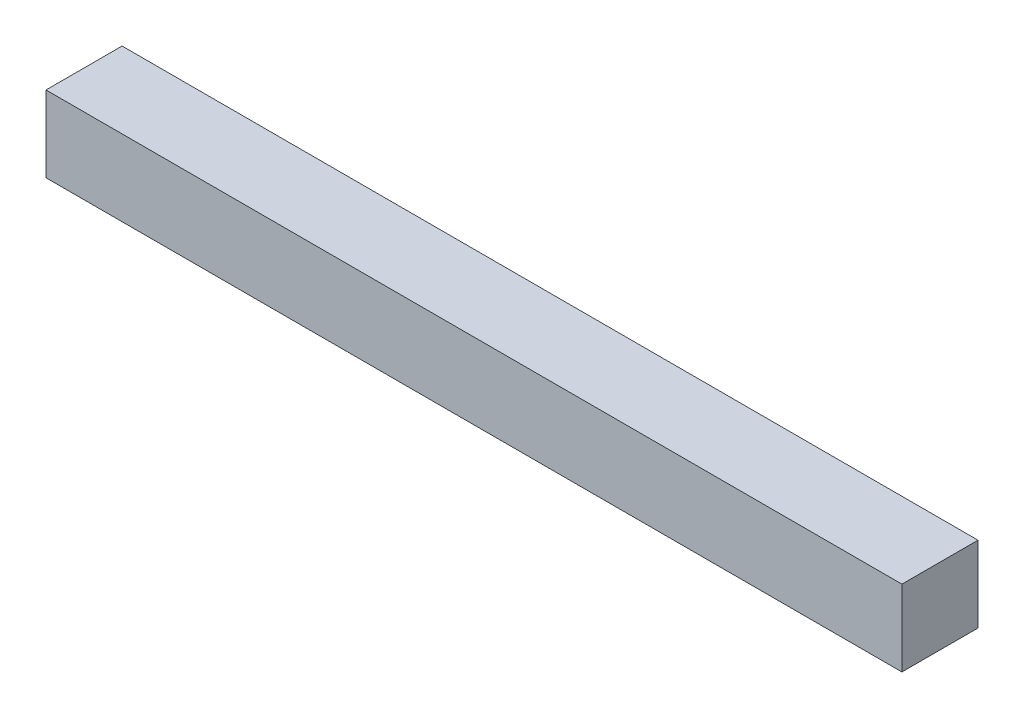
ISO-10303-21;
HEADER;
FILE_DESCRIPTION(('STEP AP214'),'2;1');
FILE_NAME('part.step','',(''),(''),'','','');
FILE_SCHEMA(('AUTOMOTIVE_DESIGN { 1 0 10303 214 1 1 1 1 }'));
ENDSEC;
DATA;
#1=APPLICATION_CONTEXT('core data for automotive mechanical design processes');
#2=APPLICATION_PROTOCOL_DEFINITION('international standard','automotive_design',2000,#1);
#3=PRODUCT_CONTEXT('',#1,'mechanical');
#4=PRODUCT('Part','Part','',(#3));
#5=PRODUCT_RELATED_PRODUCT_CATEGORY('part','',(#4));
#6=PRODUCT_DEFINITION_FORMATION('','',#4);
#7=PRODUCT_DEFINITION_CONTEXT('part definition',#1,'design');
#8=PRODUCT_DEFINITION('design','',#6,#7);
#9=PRODUCT_DEFINITION_SHAPE('','',#8);
#10=(LENGTH_UNIT() NAMED_UNIT(*) SI_UNIT(.MILLI.,.METRE.));
#11=(NAMED_UNIT(*) PLANE_ANGLE_UNIT() SI_UNIT($,.RADIAN.));
#12=(NAMED_UNIT(*) SI_UNIT($,.STERADIAN.) SOLID_ANGLE_UNIT());
#13=UNCERTAINTY_MEASURE_WITH_UNIT(LENGTH_MEASURE(1.E-05),#10,'distance_accuracy_value','');
#14=(GEOMETRIC_REPRESENTATION_CONTEXT(3) GLOBAL_UNCERTAINTY_ASSIGNED_CONTEXT((#13)) GLOBAL_UNIT_ASSIGNED_CONTEXT((#10,
#11,#12)) REPRESENTATION_CONTEXT('',''));
#15=CARTESIAN_POINT('',(0.,0.,0.));
#16=DIRECTION('',(0.,0.,1.));
#17=DIRECTION('',(1.,0.,0.));
#18=AXIS2_PLACEMENT_3D('',#15,#16,#17);
#19=CARTESIAN_POINT('',(0.,2.4,0.));
#20=DIRECTION('',(1.,0.,0.));
#21=DIRECTION('',(0.,0.,-1.));
#22=AXIS2_PLACEMENT_3D('',#19,#20,#21);
#23=PLANE('',#22);
#24=DIRECTION('',(0.,0.,1.));
#25=VECTOR('',#24,1.);
#26=CARTESIAN_POINT('',(0.,0.,0.));
#27=LINE('',#26,#25);
#28=CARTESIAN_POINT('',(0.,0.,-2.4));
#29=VERTEX_POINT('',#28);
#30=CARTESIAN_POINT('',(0.,0.,0.));
#31=VERTEX_POINT('',#30);
#32=EDGE_CURVE('E107',#29,#31,#27,.T.);
#33=ORIENTED_EDGE('',*,*,#32,.T.);
#34=DIRECTION('',(0.,-1.,0.));
#35=VECTOR('',#34,1.);
#36=CARTESIAN_POINT('',(0.,2.4,0.));
#37=LINE('',#36,#35);
#38=CARTESIAN_POINT('',(0.,2.4,0.));
#39=VERTEX_POINT('',#38);
#40=EDGE_CURVE('E11',#39,#31,#37,.T.);
#41=ORIENTED_EDGE('',*,*,#40,.F.);
#42=DIRECTION('',(0.,0.,1.));
#43=VECTOR('',#42,1.);
#44=CARTESIAN_POINT('',(0.,2.4,0.));
#45=LINE('',#44,#43);
#46=CARTESIAN_POINT('',(0.,2.4,-2.4));
#47=VERTEX_POINT('',#46);
#48=EDGE_CURVE('E91',#47,#39,#45,.T.);
#49=ORIENTED_EDGE('',*,*,#48,.F.);
#50=DIRECTION('',(0.,-1.,0.));
#51=VECTOR('',#50,1.);
#52=CARTESIAN_POINT('',(0.,2.4,-2.4));
#53=LINE('',#52,#51);
#54=EDGE_CURVE('E103',#47,#29,#53,.T.);
#55=ORIENTED_EDGE('',*,*,#54,.T.);
#56=EDGE_LOOP('',(#33,#41,#49,#55));
#57=FACE_BOUND('',#56,.T.);
#58=ADVANCED_FACE('F39',(#57),#23,.F.);
#59=CARTESIAN_POINT('',(0.,2.4,0.));
#60=DIRECTION('',(0.,0.,-1.));
#61=DIRECTION('',(-1.,0.,0.));
#62=AXIS2_PLACEMENT_3D('',#59,#60,#61);
#63=PLANE('',#62);
#64=DIRECTION('',(1.,0.,0.));
#65=VECTOR('',#64,1.);
#66=CARTESIAN_POINT('',(0.,0.,0.));
#67=LINE('',#66,#65);
#68=CARTESIAN_POINT('',(27.,0.,0.));
#69=VERTEX_POINT('',#68);
#70=EDGE_CURVE('E96',#31,#69,#67,.T.);
#71=ORIENTED_EDGE('',*,*,#70,.T.);
#72=DIRECTION('',(0.,-1.,0.));
#73=VECTOR('',#72,1.);
#74=CARTESIAN_POINT('',(27.,2.4,0.));
#75=LINE('',#74,#73);
#76=CARTESIAN_POINT('',(27.,2.4,0.));
#77=VERTEX_POINT('',#76);
#78=EDGE_CURVE('E48',#77,#69,#75,.T.);
#79=ORIENTED_EDGE('',*,*,#78,.F.);
#80=DIRECTION('',(1.,0.,0.));
#81=VECTOR('',#80,1.);
#82=CARTESIAN_POINT('',(0.,2.4,0.));
#83=LINE('',#82,#81);
#84=EDGE_CURVE('E86',#39,#77,#83,.T.);
#85=ORIENTED_EDGE('',*,*,#84,.F.);
#86=ORIENTED_EDGE('',*,*,#40,.T.);
#87=EDGE_LOOP('',(#71,#79,#85,#86));
#88=FACE_BOUND('',#87,.T.);
#89=ADVANCED_FACE('F95',(#88),#63,.F.);
#90=CARTESIAN_POINT('',(27.,2.4,0.));
#91=DIRECTION('',(-1.,0.,0.));
#92=DIRECTION('',(0.,0.,1.));
#93=AXIS2_PLACEMENT_3D('',#90,#91,#92);
#94=PLANE('',#93);
#95=DIRECTION('',(0.,0.,-1.));
#96=VECTOR('',#95,1.);
#97=CARTESIAN_POINT('',(27.,0.,0.));
#98=LINE('',#97,#96);
#99=CARTESIAN_POINT('',(27.,0.,-2.4));
#100=VERTEX_POINT('',#99);
#101=EDGE_CURVE('E73',#69,#100,#98,.T.);
#102=ORIENTED_EDGE('',*,*,#101,.T.);
#103=DIRECTION('',(0.,-1.,0.));
#104=VECTOR('',#103,1.);
#105=CARTESIAN_POINT('',(27.,2.4,-2.4));
#106=LINE('',#105,#104);
#107=CARTESIAN_POINT('',(27.,2.4,-2.4));
#108=VERTEX_POINT('',#107);
#109=EDGE_CURVE('E98',#108,#100,#106,.T.);
#110=ORIENTED_EDGE('',*,*,#109,.F.);
#111=DIRECTION('',(0.,0.,-1.));
#112=VECTOR('',#111,1.);
#113=CARTESIAN_POINT('',(27.,2.4,0.));
#114=LINE('',#113,#112);
#115=EDGE_CURVE('E89',#77,#108,#114,.T.);
#116=ORIENTED_EDGE('',*,*,#115,.F.);
#117=ORIENTED_EDGE('',*,*,#78,.T.);
#118=EDGE_LOOP('',(#102,#110,#116,#117));
#119=FACE_BOUND('',#118,.T.);
#120=ADVANCED_FACE('F99',(#119),#94,.F.);
#121=CARTESIAN_POINT('',(0.,2.4,-2.4));
#122=DIRECTION('',(0.,0.,1.));
#123=DIRECTION('',(1.,0.,0.));
#124=AXIS2_PLACEMENT_3D('',#121,#122,#123);
#125=PLANE('',#124);
#126=DIRECTION('',(-1.,0.,0.));
#127=VECTOR('',#126,1.);
#128=CARTESIAN_POINT('',(0.,0.,-2.4));
#129=LINE('',#128,#127);
#130=EDGE_CURVE('E79',#100,#29,#129,.T.);
#131=ORIENTED_EDGE('',*,*,#130,.T.);
#132=ORIENTED_EDGE('',*,*,#54,.F.);
#133=DIRECTION('',(-1.,0.,0.));
#134=VECTOR('',#133,1.);
#135=CARTESIAN_POINT('',(0.,2.4,-2.4));
#136=LINE('',#135,#134);
#137=EDGE_CURVE('E56',#108,#47,#136,.T.);
#138=ORIENTED_EDGE('',*,*,#137,.F.);
#139=ORIENTED_EDGE('',*,*,#109,.T.);
#140=EDGE_LOOP('',(#131,#132,#138,#139));
#141=FACE_BOUND('',#140,.T.);
#142=ADVANCED_FACE('F120',(#141),#125,.F.);
#143=CARTESIAN_POINT('',(0.,2.4,0.));
#144=DIRECTION('',(0.,-1.,0.));
#145=DIRECTION('',(0.,0.,-1.));
#146=AXIS2_PLACEMENT_3D('',#143,#144,#145);
#147=PLANE('',#146);
#148=ORIENTED_EDGE('',*,*,#48,.T.);
#149=ORIENTED_EDGE('',*,*,#84,.T.);
#150=ORIENTED_EDGE('',*,*,#115,.T.);
#151=ORIENTED_EDGE('',*,*,#137,.T.);
#152=EDGE_LOOP('',(#148,#149,#150,#151));
#153=FACE_BOUND('',#152,.T.);
#154=ADVANCED_FACE('F87',(#153),#147,.F.);
#155=CARTESIAN_POINT('',(0.,0.,0.));
#156=DIRECTION('',(0.,-1.,0.));
#157=DIRECTION('',(0.,0.,-1.));
#158=AXIS2_PLACEMENT_3D('',#155,#156,#157);
#159=PLANE('',#158);
#160=ORIENTED_EDGE('',*,*,#32,.F.);
#161=ORIENTED_EDGE('',*,*,#130,.F.);
#162=ORIENTED_EDGE('',*,*,#101,.F.);
#163=ORIENTED_EDGE('',*,*,#70,.F.);
#164=EDGE_LOOP('',(#160,#161,#162,#163));
#165=FACE_BOUND('',#164,.T.);
#166=ADVANCED_FACE('F123',(#165),#159,.T.);
#167=CLOSED_SHELL('',(#58,#89,#120,#142,#154,#166));
#168=MANIFOLD_SOLID_BREP('B2',#167);
#169=ADVANCED_BREP_SHAPE_REPRESENTATION('',(#18,#168),#14);
#170=SHAPE_DEFINITION_REPRESENTATION(#9,#169);
ENDSEC;
END-ISO-10303-21;
